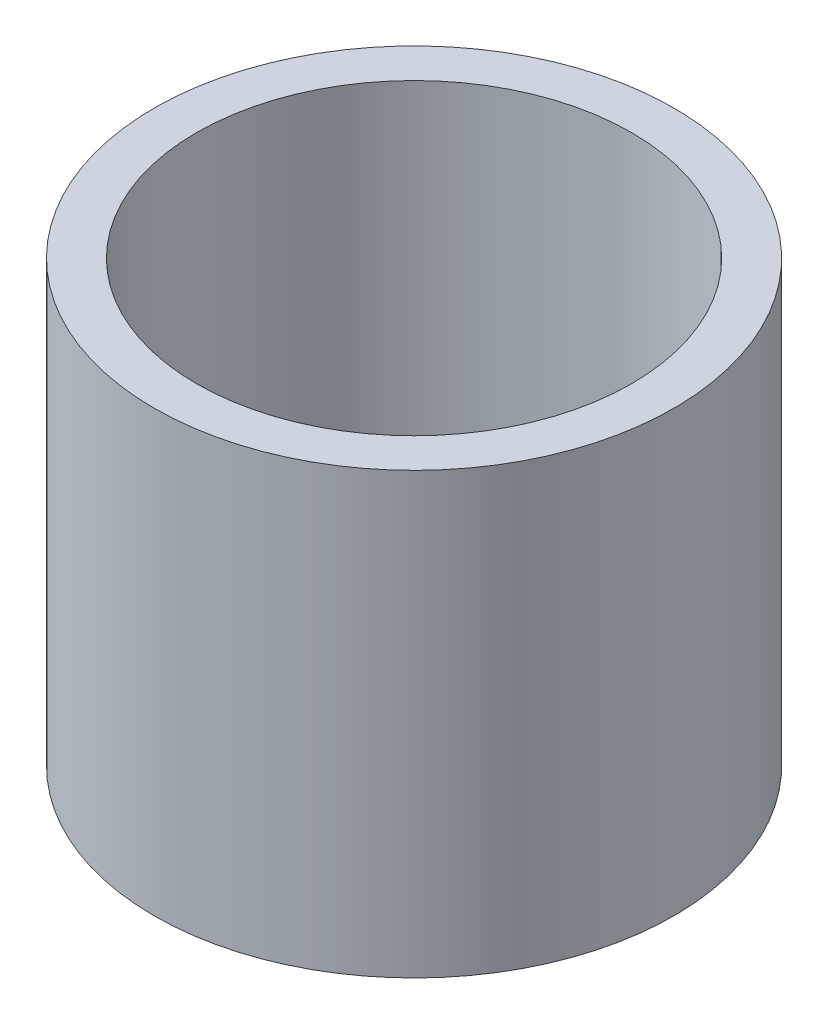
ISO-10303-21;
HEADER;
FILE_DESCRIPTION(('STEP AP214'),'2;1');
FILE_NAME('part.step','',(''),(''),'','','');
FILE_SCHEMA(('AUTOMOTIVE_DESIGN { 1 0 10303 214 1 1 1 1 }'));
ENDSEC;
DATA;
#1=APPLICATION_CONTEXT('core data for automotive mechanical design processes');
#2=APPLICATION_PROTOCOL_DEFINITION('international standard','automotive_design',2000,#1);
#3=PRODUCT_CONTEXT('',#1,'mechanical');
#4=PRODUCT('Part','Part','',(#3));
#5=PRODUCT_RELATED_PRODUCT_CATEGORY('part','',(#4));
#6=PRODUCT_DEFINITION_FORMATION('','',#4);
#7=PRODUCT_DEFINITION_CONTEXT('part definition',#1,'design');
#8=PRODUCT_DEFINITION('design','',#6,#7);
#9=PRODUCT_DEFINITION_SHAPE('','',#8);
#10=(LENGTH_UNIT() NAMED_UNIT(*) SI_UNIT(.MILLI.,.METRE.));
#11=(NAMED_UNIT(*) PLANE_ANGLE_UNIT() SI_UNIT($,.RADIAN.));
#12=(NAMED_UNIT(*) SI_UNIT($,.STERADIAN.) SOLID_ANGLE_UNIT());
#13=UNCERTAINTY_MEASURE_WITH_UNIT(LENGTH_MEASURE(1.E-05),#10,'distance_accuracy_value','');
#14=(GEOMETRIC_REPRESENTATION_CONTEXT(3) GLOBAL_UNCERTAINTY_ASSIGNED_CONTEXT((#13)) GLOBAL_UNIT_ASSIGNED_CONTEXT((#10,
#11,#12)) REPRESENTATION_CONTEXT('',''));
#15=CARTESIAN_POINT('',(0.,0.,0.));
#16=DIRECTION('',(0.,0.,1.));
#17=DIRECTION('',(1.,0.,0.));
#18=AXIS2_PLACEMENT_3D('',#15,#16,#17);
#19=CARTESIAN_POINT('',(0.,1.9812,0.));
#20=DIRECTION('',(0.,1.,0.));
#21=DIRECTION('',(0.,0.,1.));
#22=AXIS2_PLACEMENT_3D('',#19,#20,#21);
#23=PLANE('',#22);
#24=CARTESIAN_POINT('',(0.,1.9812,0.));
#25=DIRECTION('',(0.,1.,0.));
#26=DIRECTION('',(0.,0.,1.));
#27=AXIS2_PLACEMENT_3D('',#24,#25,#26);
#28=CIRCLE('',#27,5.08);
#29=CARTESIAN_POINT('',(0.,1.9812,5.08));
#30=VERTEX_POINT('',#29);
#31=EDGE_CURVE('E46',#30,#30,#28,.T.);
#32=ORIENTED_EDGE('',*,*,#31,.F.);
#33=EDGE_LOOP('',(#32));
#34=FACE_BOUND('',#33,.T.);
#35=CARTESIAN_POINT('',(0.,1.9812,0.));
#36=DIRECTION('',(0.,1.,0.));
#37=DIRECTION('',(0.,0.,1.));
#38=AXIS2_PLACEMENT_3D('',#35,#36,#37);
#39=CIRCLE('',#38,9.779);
#40=CARTESIAN_POINT('',(0.,1.9812,9.779));
#41=VERTEX_POINT('',#40);
#42=EDGE_CURVE('E10',#41,#41,#39,.F.);
#43=ORIENTED_EDGE('',*,*,#42,.F.);
#44=EDGE_LOOP('',(#43));
#45=FACE_BOUND('',#44,.T.);
#46=ADVANCED_FACE('F38',(#34,#45),#23,.T.);
#47=CARTESIAN_POINT('',(0.,1.9812,0.));
#48=DIRECTION('',(0.,-1.,0.));
#49=DIRECTION('',(0.,0.,-1.));
#50=AXIS2_PLACEMENT_3D('',#47,#48,#49);
#51=CYLINDRICAL_SURFACE('',#50,5.08);
#52=ORIENTED_EDGE('',*,*,#31,.T.);
#53=EDGE_LOOP('',(#52));
#54=FACE_BOUND('',#53,.T.);
#55=CARTESIAN_POINT('',(0.,0.,0.));
#56=DIRECTION('',(0.,1.,0.));
#57=DIRECTION('',(0.,0.,1.));
#58=AXIS2_PLACEMENT_3D('',#55,#56,#57);
#59=CIRCLE('',#58,5.08);
#60=CARTESIAN_POINT('',(0.,0.,5.08));
#61=VERTEX_POINT('',#60);
#62=EDGE_CURVE('E59',#61,#61,#59,.T.);
#63=ORIENTED_EDGE('',*,*,#62,.F.);
#64=EDGE_LOOP('',(#63));
#65=FACE_BOUND('',#64,.T.);
#66=ADVANCED_FACE('F40',(#54,#65),#51,.F.);
#67=CARTESIAN_POINT('',(0.,1.9812,0.));
#68=DIRECTION('',(0.,-1.,0.));
#69=DIRECTION('',(0.,0.,-1.));
#70=AXIS2_PLACEMENT_3D('',#67,#68,#69);
#71=CYLINDRICAL_SURFACE('',#70,11.684);
#72=CARTESIAN_POINT('',(0.,0.,0.));
#73=DIRECTION('',(0.,1.,0.));
#74=DIRECTION('',(0.,0.,1.));
#75=AXIS2_PLACEMENT_3D('',#72,#73,#74);
#76=CIRCLE('',#75,11.684);
#77=CARTESIAN_POINT('',(0.,0.,11.684));
#78=VERTEX_POINT('',#77);
#79=EDGE_CURVE('E52',#78,#78,#76,.T.);
#80=ORIENTED_EDGE('',*,*,#79,.T.);
#81=EDGE_LOOP('',(#80));
#82=FACE_BOUND('',#81,.T.);
#83=CARTESIAN_POINT('',(0.,19.7612,0.));
#84=DIRECTION('',(0.,1.,0.));
#85=DIRECTION('',(0.,0.,1.));
#86=AXIS2_PLACEMENT_3D('',#83,#84,#85);
#87=CIRCLE('',#86,11.684);
#88=CARTESIAN_POINT('',(0.,19.7612,11.684));
#89=VERTEX_POINT('',#88);
#90=EDGE_CURVE('E62',#89,#89,#87,.T.);
#91=ORIENTED_EDGE('',*,*,#90,.F.);
#92=EDGE_LOOP('',(#91));
#93=FACE_BOUND('',#92,.T.);
#94=ADVANCED_FACE('F91',(#82,#93),#71,.T.);
#95=CARTESIAN_POINT('',(0.,0.,0.));
#96=DIRECTION('',(0.,1.,0.));
#97=DIRECTION('',(0.,0.,1.));
#98=AXIS2_PLACEMENT_3D('',#95,#96,#97);
#99=PLANE('',#98);
#100=ORIENTED_EDGE('',*,*,#62,.T.);
#101=EDGE_LOOP('',(#100));
#102=FACE_BOUND('',#101,.T.);
#103=ORIENTED_EDGE('',*,*,#79,.F.);
#104=EDGE_LOOP('',(#103));
#105=FACE_BOUND('',#104,.T.);
#106=ADVANCED_FACE('F84',(#102,#105),#99,.F.);
#107=CARTESIAN_POINT('',(0.,19.7612,0.));
#108=DIRECTION('',(0.,1.,0.));
#109=DIRECTION('',(0.,0.,1.));
#110=AXIS2_PLACEMENT_3D('',#107,#108,#109);
#111=PLANE('',#110);
#112=ORIENTED_EDGE('',*,*,#90,.T.);
#113=EDGE_LOOP('',(#112));
#114=FACE_BOUND('',#113,.T.);
#115=CARTESIAN_POINT('',(0.,19.7612,0.));
#116=DIRECTION('',(0.,1.,0.));
#117=DIRECTION('',(0.,0.,1.));
#118=AXIS2_PLACEMENT_3D('',#115,#116,#117);
#119=CIRCLE('',#118,9.779);
#120=CARTESIAN_POINT('',(0.,19.7612,9.779));
#121=VERTEX_POINT('',#120);
#122=EDGE_CURVE('E71',#121,#121,#119,.T.);
#123=ORIENTED_EDGE('',*,*,#122,.F.);
#124=EDGE_LOOP('',(#123));
#125=FACE_BOUND('',#124,.T.);
#126=ADVANCED_FACE('F82',(#114,#125),#111,.T.);
#127=CARTESIAN_POINT('',(0.,19.7612,0.));
#128=DIRECTION('',(0.,-1.,0.));
#129=DIRECTION('',(0.,0.,-1.));
#130=AXIS2_PLACEMENT_3D('',#127,#128,#129);
#131=CYLINDRICAL_SURFACE('',#130,9.779);
#132=ORIENTED_EDGE('',*,*,#122,.T.);
#133=EDGE_LOOP('',(#132));
#134=FACE_BOUND('',#133,.T.);
#135=ORIENTED_EDGE('',*,*,#42,.T.);
#136=EDGE_LOOP('',(#135));
#137=FACE_BOUND('',#136,.T.);
#138=ADVANCED_FACE('F80',(#134,#137),#131,.F.);
#139=CLOSED_SHELL('',(#46,#66,#94,#106,#126,#138));
#140=MANIFOLD_SOLID_BREP('B2',#139);
#141=ADVANCED_BREP_SHAPE_REPRESENTATION('',(#18,#140),#14);
#142=SHAPE_DEFINITION_REPRESENTATION(#9,#141);
ENDSEC;
END-ISO-10303-21;
